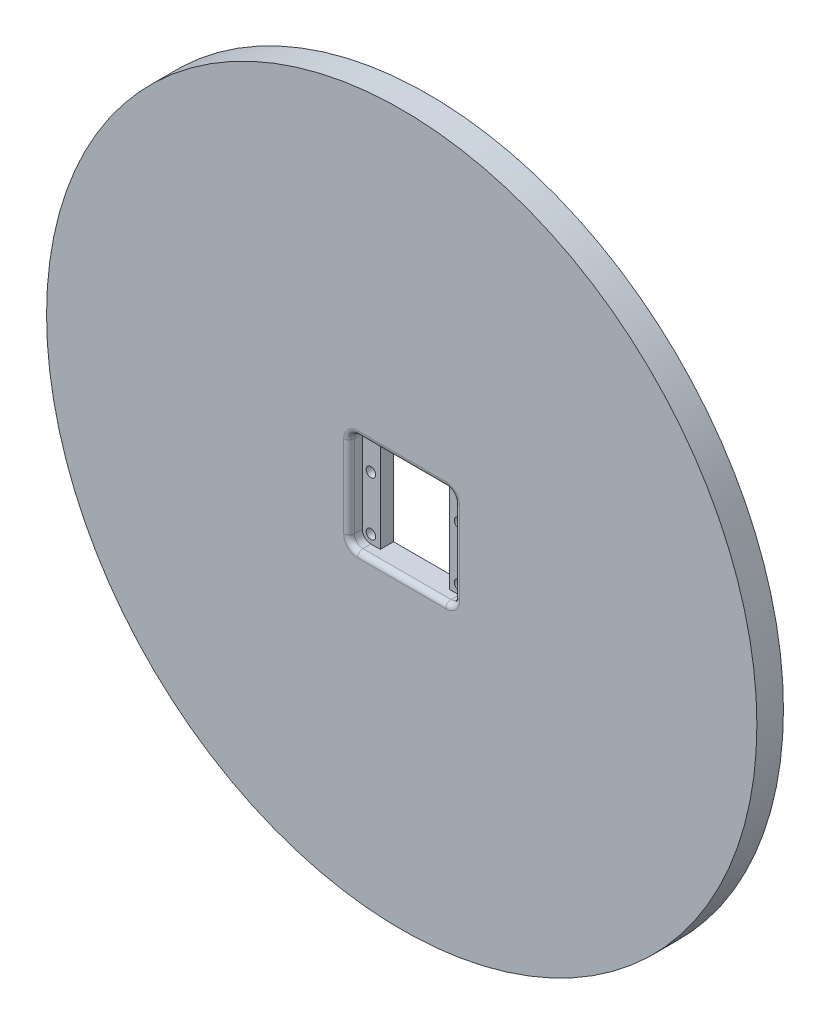
ISO-10303-21;
HEADER;
FILE_DESCRIPTION(('STEP AP214'),'2;1');
FILE_NAME('part.step','',(''),(''),'','','');
FILE_SCHEMA(('AUTOMOTIVE_DESIGN { 1 0 10303 214 1 1 1 1 }'));
ENDSEC;
DATA;
#1=APPLICATION_CONTEXT('core data for automotive mechanical design processes');
#2=APPLICATION_PROTOCOL_DEFINITION('international standard','automotive_design',2000,#1);
#3=PRODUCT_CONTEXT('',#1,'mechanical');
#4=PRODUCT('Part','Part','',(#3));
#5=PRODUCT_RELATED_PRODUCT_CATEGORY('part','',(#4));
#6=PRODUCT_DEFINITION_FORMATION('','',#4);
#7=PRODUCT_DEFINITION_CONTEXT('part definition',#1,'design');
#8=PRODUCT_DEFINITION('design','',#6,#7);
#9=PRODUCT_DEFINITION_SHAPE('','',#8);
#10=(LENGTH_UNIT() NAMED_UNIT(*) SI_UNIT(.MILLI.,.METRE.));
#11=(NAMED_UNIT(*) PLANE_ANGLE_UNIT() SI_UNIT($,.RADIAN.));
#12=(NAMED_UNIT(*) SI_UNIT($,.STERADIAN.) SOLID_ANGLE_UNIT());
#13=UNCERTAINTY_MEASURE_WITH_UNIT(LENGTH_MEASURE(1.E-05),#10,'distance_accuracy_value','');
#14=(GEOMETRIC_REPRESENTATION_CONTEXT(3) GLOBAL_UNCERTAINTY_ASSIGNED_CONTEXT((#13)) GLOBAL_UNIT_ASSIGNED_CONTEXT((#10,
#11,#12)) REPRESENTATION_CONTEXT('',''));
#15=CARTESIAN_POINT('',(0.,0.,0.));
#16=DIRECTION('',(0.,0.,1.));
#17=DIRECTION('',(1.,0.,0.));
#18=AXIS2_PLACEMENT_3D('',#15,#16,#17);
#19=CARTESIAN_POINT('',(0.,0.,3.175));
#20=DIRECTION('',(0.,0.,1.));
#21=DIRECTION('',(1.,0.,0.));
#22=AXIS2_PLACEMENT_3D('',#19,#20,#21);
#23=PLANE('',#22);
#24=DIRECTION('',(0.,-1.,0.));
#25=VECTOR('',#24,1.);
#26=CARTESIAN_POINT('',(-8.3058,11.8999,3.175));
#27=LINE('',#26,#25);
#28=CARTESIAN_POINT('',(-8.3058,11.8999,3.175));
#29=VERTEX_POINT('',#28);
#30=CARTESIAN_POINT('',(-8.3058,-11.8999,3.175));
#31=VERTEX_POINT('',#30);
#32=EDGE_CURVE('E173',#29,#31,#27,.T.);
#33=ORIENTED_EDGE('',*,*,#32,.F.);
#34=DIRECTION('',(1.,0.,0.));
#35=VECTOR('',#34,1.);
#36=CARTESIAN_POINT('',(10.541,11.8999,3.175));
#37=LINE('',#36,#35);
#38=CARTESIAN_POINT('',(-10.541,11.8999,3.175));
#39=VERTEX_POINT('',#38);
#40=EDGE_CURVE('E374',#39,#29,#37,.T.);
#41=ORIENTED_EDGE('',*,*,#40,.F.);
#42=CARTESIAN_POINT('',(-10.541,9.8425,3.175));
#43=DIRECTION('',(0.,0.,1.));
#44=DIRECTION('',(1.,0.,0.));
#45=AXIS2_PLACEMENT_3D('',#42,#43,#44);
#46=CIRCLE('',#45,2.0574);
#47=CARTESIAN_POINT('',(-12.5984,9.84249999999998,3.175));
#48=VERTEX_POINT('',#47);
#49=EDGE_CURVE('E377',#48,#39,#46,.F.);
#50=ORIENTED_EDGE('',*,*,#49,.F.);
#51=DIRECTION('',(0.,1.,0.));
#52=VECTOR('',#51,1.);
#53=CARTESIAN_POINT('',(-12.5984,9.84249999999998,3.175));
#54=LINE('',#53,#52);
#55=CARTESIAN_POINT('',(-12.5984,-9.84249999999999,3.175));
#56=VERTEX_POINT('',#55);
#57=EDGE_CURVE('E379',#56,#48,#54,.T.);
#58=ORIENTED_EDGE('',*,*,#57,.F.);
#59=CARTESIAN_POINT('',(-10.541,-9.8425,3.175));
#60=DIRECTION('',(0.,0.,1.));
#61=DIRECTION('',(1.,0.,0.));
#62=AXIS2_PLACEMENT_3D('',#59,#60,#61);
#63=CIRCLE('',#62,2.0574);
#64=CARTESIAN_POINT('',(-10.541,-11.8999,3.175));
#65=VERTEX_POINT('',#64);
#66=EDGE_CURVE('E186',#56,#65,#63,.T.);
#67=ORIENTED_EDGE('',*,*,#66,.T.);
#68=DIRECTION('',(1.,0.,0.));
#69=VECTOR('',#68,1.);
#70=CARTESIAN_POINT('',(10.541,-11.8999,3.175));
#71=LINE('',#70,#69);
#72=EDGE_CURVE('E163',#65,#31,#71,.T.);
#73=ORIENTED_EDGE('',*,*,#72,.T.);
#74=EDGE_LOOP('',(#33,#41,#50,#58,#67,#73));
#75=FACE_BOUND('',#74,.T.);
#76=CARTESIAN_POINT('',(-10.541,2.9845,3.175));
#77=DIRECTION('',(0.,0.,1.));
#78=DIRECTION('',(1.,0.,0.));
#79=AXIS2_PLACEMENT_3D('',#76,#77,#78);
#80=CIRCLE('',#79,1.143);
#81=CARTESIAN_POINT('',(-9.398,2.9845,3.175));
#82=VERTEX_POINT('',#81);
#83=EDGE_CURVE('E311',#82,#82,#80,.T.);
#84=ORIENTED_EDGE('',*,*,#83,.F.);
#85=EDGE_LOOP('',(#84));
#86=FACE_BOUND('',#85,.T.);
#87=CARTESIAN_POINT('',(-10.541,-9.8425,3.175));
#88=DIRECTION('',(0.,0.,1.));
#89=DIRECTION('',(1.,0.,0.));
#90=AXIS2_PLACEMENT_3D('',#87,#88,#89);
#91=CIRCLE('',#90,1.143);
#92=CARTESIAN_POINT('',(-9.398,-9.8425,3.175));
#93=VERTEX_POINT('',#92);
#94=EDGE_CURVE('E353',#93,#93,#91,.T.);
#95=ORIENTED_EDGE('',*,*,#94,.F.);
#96=EDGE_LOOP('',(#95));
#97=FACE_BOUND('',#96,.T.);
#98=ADVANCED_FACE('F43',(#75,#86,#97),#23,.T.);
#99=CARTESIAN_POINT('',(0.,0.,6.35));
#100=DIRECTION('',(0.,0.,1.));
#101=DIRECTION('',(1.,0.,0.));
#102=AXIS2_PLACEMENT_3D('',#99,#100,#101);
#103=PLANE('',#102);
#104=DIRECTION('',(0.,-1.,0.));
#105=VECTOR('',#104,1.);
#106=CARTESIAN_POINT('',(13.8684,0.,6.35));
#107=LINE('',#106,#105);
#108=CARTESIAN_POINT('',(13.8684,9.84249999999999,6.35));
#109=VERTEX_POINT('',#108);
#110=CARTESIAN_POINT('',(13.8684,-9.84249999999997,6.35));
#111=VERTEX_POINT('',#110);
#112=EDGE_CURVE('E255',#109,#111,#107,.T.);
#113=ORIENTED_EDGE('',*,*,#112,.T.);
#114=CARTESIAN_POINT('',(10.541,-9.8425,6.35));
#115=DIRECTION('',(0.,0.,1.));
#116=DIRECTION('',(1.,0.,0.));
#117=AXIS2_PLACEMENT_3D('',#114,#115,#116);
#118=CIRCLE('',#117,3.3274);
#119=CARTESIAN_POINT('',(10.541,-13.1699,6.35));
#120=VERTEX_POINT('',#119);
#121=EDGE_CURVE('E258',#111,#120,#118,.F.);
#122=ORIENTED_EDGE('',*,*,#121,.T.);
#123=DIRECTION('',(-1.,0.,0.));
#124=VECTOR('',#123,1.);
#125=CARTESIAN_POINT('',(0.,-13.1699,6.35));
#126=LINE('',#125,#124);
#127=CARTESIAN_POINT('',(-10.541,-13.1699,6.35));
#128=VERTEX_POINT('',#127);
#129=EDGE_CURVE('E236',#120,#128,#126,.T.);
#130=ORIENTED_EDGE('',*,*,#129,.T.);
#131=CARTESIAN_POINT('',(-10.541,-9.8425,6.35));
#132=DIRECTION('',(0.,0.,1.));
#133=DIRECTION('',(1.,0.,0.));
#134=AXIS2_PLACEMENT_3D('',#131,#132,#133);
#135=CIRCLE('',#134,3.3274);
#136=CARTESIAN_POINT('',(-13.8684,-9.84249999999999,6.35));
#137=VERTEX_POINT('',#136);
#138=EDGE_CURVE('E240',#128,#137,#135,.F.);
#139=ORIENTED_EDGE('',*,*,#138,.T.);
#140=DIRECTION('',(0.,-1.,0.));
#141=VECTOR('',#140,1.);
#142=CARTESIAN_POINT('',(-13.8684,9.84249999999998,6.35));
#143=LINE('',#142,#141);
#144=CARTESIAN_POINT('',(-13.8684,9.84249999999997,6.35));
#145=VERTEX_POINT('',#144);
#146=EDGE_CURVE('E243',#137,#145,#143,.F.);
#147=ORIENTED_EDGE('',*,*,#146,.T.);
#148=CARTESIAN_POINT('',(-10.541,9.8425,6.35));
#149=DIRECTION('',(0.,0.,1.));
#150=DIRECTION('',(1.,0.,0.));
#151=AXIS2_PLACEMENT_3D('',#148,#149,#150);
#152=CIRCLE('',#151,3.3274);
#153=CARTESIAN_POINT('',(-10.541,13.1699,6.35));
#154=VERTEX_POINT('',#153);
#155=EDGE_CURVE('E246',#145,#154,#152,.F.);
#156=ORIENTED_EDGE('',*,*,#155,.T.);
#157=DIRECTION('',(-1.,0.,0.));
#158=VECTOR('',#157,1.);
#159=CARTESIAN_POINT('',(10.541,13.1699,6.35));
#160=LINE('',#159,#158);
#161=CARTESIAN_POINT('',(10.541,13.1699,6.35));
#162=VERTEX_POINT('',#161);
#163=EDGE_CURVE('E249',#154,#162,#160,.F.);
#164=ORIENTED_EDGE('',*,*,#163,.T.);
#165=CARTESIAN_POINT('',(10.541,9.8425,6.35));
#166=DIRECTION('',(0.,0.,1.));
#167=DIRECTION('',(1.,0.,0.));
#168=AXIS2_PLACEMENT_3D('',#165,#166,#167);
#169=CIRCLE('',#168,3.3274);
#170=EDGE_CURVE('E252',#162,#109,#169,.F.);
#171=ORIENTED_EDGE('',*,*,#170,.T.);
#172=EDGE_LOOP('',(#113,#122,#130,#139,#147,#156,#164,#171));
#173=FACE_BOUND('',#172,.T.);
#174=CARTESIAN_POINT('',(0.,0.,6.35));
#175=DIRECTION('',(0.,0.,1.));
#176=DIRECTION('',(1.,0.,0.));
#177=AXIS2_PLACEMENT_3D('',#174,#175,#176);
#178=CIRCLE('',#177,84.93125);
#179=CARTESIAN_POINT('',(84.93125,0.,6.35));
#180=VERTEX_POINT('',#179);
#181=EDGE_CURVE('E194',#180,#180,#178,.T.);
#182=ORIENTED_EDGE('',*,*,#181,.T.);
#183=EDGE_LOOP('',(#182));
#184=FACE_BOUND('',#183,.T.);
#185=ADVANCED_FACE('F434',(#173,#184),#103,.T.);
#186=CARTESIAN_POINT('',(0.,0.,6.35));
#187=DIRECTION('',(0.,0.,-1.));
#188=DIRECTION('',(-1.,0.,0.));
#189=AXIS2_PLACEMENT_3D('',#186,#187,#188);
#190=CYLINDRICAL_SURFACE('',#189,84.93125);
#191=ORIENTED_EDGE('',*,*,#181,.F.);
#192=EDGE_LOOP('',(#191));
#193=FACE_BOUND('',#192,.T.);
#194=CARTESIAN_POINT('',(0.,0.,0.));
#195=DIRECTION('',(0.,0.,1.));
#196=DIRECTION('',(1.,0.,0.));
#197=AXIS2_PLACEMENT_3D('',#194,#195,#196);
#198=CIRCLE('',#197,84.93125);
#199=CARTESIAN_POINT('',(84.93125,0.,0.));
#200=VERTEX_POINT('',#199);
#201=EDGE_CURVE('E188',#200,#200,#198,.T.);
#202=ORIENTED_EDGE('',*,*,#201,.T.);
#203=EDGE_LOOP('',(#202));
#204=FACE_BOUND('',#203,.T.);
#205=ADVANCED_FACE('F437',(#193,#204),#190,.T.);
#206=CARTESIAN_POINT('',(0.,0.,0.));
#207=DIRECTION('',(0.,0.,1.));
#208=DIRECTION('',(1.,0.,0.));
#209=AXIS2_PLACEMENT_3D('',#206,#207,#208);
#210=PLANE('',#209);
#211=DIRECTION('',(1.,0.,0.));
#212=VECTOR('',#211,1.);
#213=CARTESIAN_POINT('',(8.3058,11.8999,0.));
#214=LINE('',#213,#212);
#215=CARTESIAN_POINT('',(-8.3058,11.8999,0.));
#216=VERTEX_POINT('',#215);
#217=CARTESIAN_POINT('',(8.3058,11.8999,0.));
#218=VERTEX_POINT('',#217);
#219=EDGE_CURVE('E334',#216,#218,#214,.T.);
#220=ORIENTED_EDGE('',*,*,#219,.F.);
#221=DIRECTION('',(0.,1.,0.));
#222=VECTOR('',#221,1.);
#223=CARTESIAN_POINT('',(-8.3058,11.8999,0.));
#224=LINE('',#223,#222);
#225=CARTESIAN_POINT('',(-8.3058,-11.8999,0.));
#226=VERTEX_POINT('',#225);
#227=EDGE_CURVE('E337',#226,#216,#224,.T.);
#228=ORIENTED_EDGE('',*,*,#227,.F.);
#229=DIRECTION('',(-1.,0.,0.));
#230=VECTOR('',#229,1.);
#231=CARTESIAN_POINT('',(8.3058,-11.8999,0.));
#232=LINE('',#231,#230);
#233=CARTESIAN_POINT('',(8.3058,-11.8999,0.));
#234=VERTEX_POINT('',#233);
#235=EDGE_CURVE('E165',#234,#226,#232,.T.);
#236=ORIENTED_EDGE('',*,*,#235,.F.);
#237=DIRECTION('',(0.,-1.,0.));
#238=VECTOR('',#237,1.);
#239=CARTESIAN_POINT('',(8.3058,-11.8999,0.));
#240=LINE('',#239,#238);
#241=EDGE_CURVE('E330',#218,#234,#240,.T.);
#242=ORIENTED_EDGE('',*,*,#241,.F.);
#243=EDGE_LOOP('',(#220,#228,#236,#242));
#244=FACE_BOUND('',#243,.T.);
#245=CARTESIAN_POINT('',(-10.541,-9.8425,0.));
#246=DIRECTION('',(0.,0.,1.));
#247=DIRECTION('',(1.,0.,0.));
#248=AXIS2_PLACEMENT_3D('',#245,#246,#247);
#249=CIRCLE('',#248,1.143);
#250=CARTESIAN_POINT('',(-9.398,-9.8425,0.));
#251=VERTEX_POINT('',#250);
#252=EDGE_CURVE('E181',#251,#251,#249,.F.);
#253=ORIENTED_EDGE('',*,*,#252,.F.);
#254=EDGE_LOOP('',(#253));
#255=FACE_BOUND('',#254,.T.);
#256=CARTESIAN_POINT('',(10.541,2.9845,0.));
#257=DIRECTION('',(0.,0.,1.));
#258=DIRECTION('',(1.,0.,0.));
#259=AXIS2_PLACEMENT_3D('',#256,#257,#258);
#260=CIRCLE('',#259,1.143);
#261=CARTESIAN_POINT('',(11.684,2.9845,0.));
#262=VERTEX_POINT('',#261);
#263=EDGE_CURVE('E327',#262,#262,#260,.F.);
#264=ORIENTED_EDGE('',*,*,#263,.F.);
#265=EDGE_LOOP('',(#264));
#266=FACE_BOUND('',#265,.T.);
#267=CARTESIAN_POINT('',(-10.541,2.9845,0.));
#268=DIRECTION('',(0.,0.,1.));
#269=DIRECTION('',(1.,0.,0.));
#270=AXIS2_PLACEMENT_3D('',#267,#268,#269);
#271=CIRCLE('',#270,1.143);
#272=CARTESIAN_POINT('',(-9.398,2.9845,0.));
#273=VERTEX_POINT('',#272);
#274=EDGE_CURVE('E318',#273,#273,#271,.F.);
#275=ORIENTED_EDGE('',*,*,#274,.F.);
#276=EDGE_LOOP('',(#275));
#277=FACE_BOUND('',#276,.T.);
#278=CARTESIAN_POINT('',(10.541,-9.8425,0.));
#279=DIRECTION('',(0.,0.,1.));
#280=DIRECTION('',(1.,0.,0.));
#281=AXIS2_PLACEMENT_3D('',#278,#279,#280);
#282=CIRCLE('',#281,1.143);
#283=CARTESIAN_POINT('',(11.684,-9.8425,0.));
#284=VERTEX_POINT('',#283);
#285=EDGE_CURVE('E204',#284,#284,#282,.F.);
#286=ORIENTED_EDGE('',*,*,#285,.F.);
#287=EDGE_LOOP('',(#286));
#288=FACE_BOUND('',#287,.T.);
#289=ORIENTED_EDGE('',*,*,#201,.F.);
#290=EDGE_LOOP('',(#289));
#291=FACE_BOUND('',#290,.T.);
#292=ADVANCED_FACE('F443',(#244,#255,#266,#277,#288,#291),#210,.F.);
#293=CARTESIAN_POINT('',(10.541,-9.8425,-34.659907822728));
#294=DIRECTION('',(0.,0.,1.));
#295=DIRECTION('',(1.,0.,0.));
#296=AXIS2_PLACEMENT_3D('',#293,#294,#295);
#297=CYLINDRICAL_SURFACE('',#296,2.0574);
#298=DIRECTION('',(0.,0.,1.));
#299=VECTOR('',#298,1.);
#300=CARTESIAN_POINT('',(10.541,-11.8999,-34.659907822728));
#301=LINE('',#300,#299);
#302=CARTESIAN_POINT('',(10.541,-11.8999,3.175));
#303=VERTEX_POINT('',#302);
#304=CARTESIAN_POINT('',(10.541,-11.8999,5.08));
#305=VERTEX_POINT('',#304);
#306=EDGE_CURVE('E199',#303,#305,#301,.T.);
#307=ORIENTED_EDGE('',*,*,#306,.T.);
#308=CARTESIAN_POINT('',(10.541,-9.8425,5.08));
#309=DIRECTION('',(0.,0.,1.));
#310=DIRECTION('',(1.,0.,0.));
#311=AXIS2_PLACEMENT_3D('',#308,#309,#310);
#312=CIRCLE('',#311,2.0574);
#313=CARTESIAN_POINT('',(12.5984,-9.84249999999999,5.08));
#314=VERTEX_POINT('',#313);
#315=EDGE_CURVE('E262',#305,#314,#312,.T.);
#316=ORIENTED_EDGE('',*,*,#315,.T.);
#317=DIRECTION('',(0.,0.,1.));
#318=VECTOR('',#317,1.);
#319=CARTESIAN_POINT('',(12.5984,-9.84249999999999,-34.659907822728));
#320=LINE('',#319,#318);
#321=CARTESIAN_POINT('',(12.5984,-9.84249999999999,3.175));
#322=VERTEX_POINT('',#321);
#323=EDGE_CURVE('E203',#322,#314,#320,.T.);
#324=ORIENTED_EDGE('',*,*,#323,.F.);
#325=CARTESIAN_POINT('',(10.541,-9.8425,3.175));
#326=DIRECTION('',(0.,0.,1.));
#327=DIRECTION('',(1.,0.,0.));
#328=AXIS2_PLACEMENT_3D('',#325,#326,#327);
#329=CIRCLE('',#328,2.0574);
#330=EDGE_CURVE('E229',#303,#322,#329,.T.);
#331=ORIENTED_EDGE('',*,*,#330,.F.);
#332=EDGE_LOOP('',(#307,#316,#324,#331));
#333=FACE_BOUND('',#332,.T.);
#334=ADVANCED_FACE('F410',(#333),#297,.F.);
#335=CARTESIAN_POINT('',(12.5984,9.84249999999999,-34.659907822728));
#336=DIRECTION('',(-1.,0.,0.));
#337=DIRECTION('',(0.,-1.,0.));
#338=AXIS2_PLACEMENT_3D('',#335,#336,#337);
#339=PLANE('',#338);
#340=ORIENTED_EDGE('',*,*,#323,.T.);
#341=DIRECTION('',(0.,-1.,0.));
#342=VECTOR('',#341,1.);
#343=CARTESIAN_POINT('',(12.5984,9.84249999999999,5.08));
#344=LINE('',#343,#342);
#345=CARTESIAN_POINT('',(12.5984,9.84249999999999,5.08));
#346=VERTEX_POINT('',#345);
#347=EDGE_CURVE('E266',#314,#346,#344,.F.);
#348=ORIENTED_EDGE('',*,*,#347,.T.);
#349=DIRECTION('',(0.,0.,1.));
#350=VECTOR('',#349,1.);
#351=CARTESIAN_POINT('',(12.5984,9.84249999999999,-34.659907822728));
#352=LINE('',#351,#350);
#353=CARTESIAN_POINT('',(12.5984,9.84249999999999,3.175));
#354=VERTEX_POINT('',#353);
#355=EDGE_CURVE('E208',#354,#346,#352,.T.);
#356=ORIENTED_EDGE('',*,*,#355,.F.);
#357=DIRECTION('',(0.,1.,0.));
#358=VECTOR('',#357,1.);
#359=CARTESIAN_POINT('',(12.5984,9.84249999999999,3.175));
#360=LINE('',#359,#358);
#361=EDGE_CURVE('E233',#322,#354,#360,.T.);
#362=ORIENTED_EDGE('',*,*,#361,.F.);
#363=EDGE_LOOP('',(#340,#348,#356,#362));
#364=FACE_BOUND('',#363,.T.);
#365=ADVANCED_FACE('F423',(#364),#339,.T.);
#366=CARTESIAN_POINT('',(10.541,9.8425,-34.659907822728));
#367=DIRECTION('',(0.,0.,1.));
#368=DIRECTION('',(1.,0.,0.));
#369=AXIS2_PLACEMENT_3D('',#366,#367,#368);
#370=CYLINDRICAL_SURFACE('',#369,2.0574);
#371=ORIENTED_EDGE('',*,*,#355,.T.);
#372=CARTESIAN_POINT('',(10.541,9.8425,5.08));
#373=DIRECTION('',(0.,0.,1.));
#374=DIRECTION('',(1.,0.,0.));
#375=AXIS2_PLACEMENT_3D('',#372,#373,#374);
#376=CIRCLE('',#375,2.0574);
#377=CARTESIAN_POINT('',(10.541,11.8999,5.08));
#378=VERTEX_POINT('',#377);
#379=EDGE_CURVE('E269',#346,#378,#376,.T.);
#380=ORIENTED_EDGE('',*,*,#379,.T.);
#381=DIRECTION('',(0.,0.,1.));
#382=VECTOR('',#381,1.);
#383=CARTESIAN_POINT('',(10.541,11.8999,-34.659907822728));
#384=LINE('',#383,#382);
#385=CARTESIAN_POINT('',(10.541,11.8999,3.175));
#386=VERTEX_POINT('',#385);
#387=EDGE_CURVE('E212',#386,#378,#384,.T.);
#388=ORIENTED_EDGE('',*,*,#387,.F.);
#389=CARTESIAN_POINT('',(10.541,9.8425,3.175));
#390=DIRECTION('',(0.,0.,1.));
#391=DIRECTION('',(1.,0.,0.));
#392=AXIS2_PLACEMENT_3D('',#389,#390,#391);
#393=CIRCLE('',#392,2.0574);
#394=EDGE_CURVE('E369',#354,#386,#393,.T.);
#395=ORIENTED_EDGE('',*,*,#394,.F.);
#396=EDGE_LOOP('',(#371,#380,#388,#395));
#397=FACE_BOUND('',#396,.T.);
#398=ADVANCED_FACE('F426',(#397),#370,.F.);
#399=CARTESIAN_POINT('',(10.541,11.8999,-34.659907822728));
#400=DIRECTION('',(0.,1.,0.));
#401=DIRECTION('',(-1.,0.,0.));
#402=AXIS2_PLACEMENT_3D('',#399,#400,#401);
#403=PLANE('',#402);
#404=ORIENTED_EDGE('',*,*,#387,.T.);
#405=DIRECTION('',(-1.,0.,0.));
#406=VECTOR('',#405,1.);
#407=CARTESIAN_POINT('',(-10.541,11.8999,5.08));
#408=LINE('',#407,#406);
#409=CARTESIAN_POINT('',(-10.541,11.8999,5.08));
#410=VERTEX_POINT('',#409);
#411=EDGE_CURVE('E272',#378,#410,#408,.T.);
#412=ORIENTED_EDGE('',*,*,#411,.T.);
#413=DIRECTION('',(0.,0.,1.));
#414=VECTOR('',#413,1.);
#415=CARTESIAN_POINT('',(-10.541,11.8999,-34.659907822728));
#416=LINE('',#415,#414);
#417=EDGE_CURVE('E216',#39,#410,#416,.T.);
#418=ORIENTED_EDGE('',*,*,#417,.F.);
#419=ORIENTED_EDGE('',*,*,#40,.T.);
#420=DIRECTION('',(0.,0.,1.));
#421=VECTOR('',#420,1.);
#422=CARTESIAN_POINT('',(-8.3058,11.8999,-29.023709869691));
#423=LINE('',#422,#421);
#424=EDGE_CURVE('E176',#216,#29,#423,.T.);
#425=ORIENTED_EDGE('',*,*,#424,.F.);
#426=ORIENTED_EDGE('',*,*,#219,.T.);
#427=DIRECTION('',(0.,0.,1.));
#428=VECTOR('',#427,1.);
#429=CARTESIAN_POINT('',(8.3058,11.8999,-29.023709869691));
#430=LINE('',#429,#428);
#431=CARTESIAN_POINT('',(8.3058,11.8999,3.175));
#432=VERTEX_POINT('',#431);
#433=EDGE_CURVE('E345',#218,#432,#430,.T.);
#434=ORIENTED_EDGE('',*,*,#433,.T.);
#435=EDGE_CURVE('E373',#432,#386,#37,.T.);
#436=ORIENTED_EDGE('',*,*,#435,.T.);
#437=EDGE_LOOP('',(#404,#412,#418,#419,#425,#426,#434,#436));
#438=FACE_BOUND('',#437,.T.);
#439=ADVANCED_FACE('F390',(#438),#403,.F.);
#440=CARTESIAN_POINT('',(-10.541,9.8425,-34.659907822728));
#441=DIRECTION('',(0.,0.,1.));
#442=DIRECTION('',(1.,0.,0.));
#443=AXIS2_PLACEMENT_3D('',#440,#441,#442);
#444=CYLINDRICAL_SURFACE('',#443,2.0574);
#445=ORIENTED_EDGE('',*,*,#417,.T.);
#446=CARTESIAN_POINT('',(-10.541,9.8425,5.08));
#447=DIRECTION('',(0.,0.,1.));
#448=DIRECTION('',(1.,0.,0.));
#449=AXIS2_PLACEMENT_3D('',#446,#447,#448);
#450=CIRCLE('',#449,2.0574);
#451=CARTESIAN_POINT('',(-12.5984,9.84249999999998,5.08));
#452=VERTEX_POINT('',#451);
#453=EDGE_CURVE('E275',#410,#452,#450,.T.);
#454=ORIENTED_EDGE('',*,*,#453,.T.);
#455=DIRECTION('',(0.,0.,1.));
#456=VECTOR('',#455,1.);
#457=CARTESIAN_POINT('',(-12.5984,9.84249999999998,-34.659907822728));
#458=LINE('',#457,#456);
#459=EDGE_CURVE('E220',#48,#452,#458,.T.);
#460=ORIENTED_EDGE('',*,*,#459,.F.);
#461=ORIENTED_EDGE('',*,*,#49,.T.);
#462=EDGE_LOOP('',(#445,#454,#460,#461));
#463=FACE_BOUND('',#462,.T.);
#464=ADVANCED_FACE('F386',(#463),#444,.F.);
#465=CARTESIAN_POINT('',(-12.5984,9.84249999999998,-34.659907822728));
#466=DIRECTION('',(-1.,0.,0.));
#467=DIRECTION('',(0.,-1.,0.));
#468=AXIS2_PLACEMENT_3D('',#465,#466,#467);
#469=PLANE('',#468);
#470=ORIENTED_EDGE('',*,*,#459,.T.);
#471=DIRECTION('',(0.,-1.,0.));
#472=VECTOR('',#471,1.);
#473=CARTESIAN_POINT('',(-12.5984,-9.84249999999999,5.08));
#474=LINE('',#473,#472);
#475=CARTESIAN_POINT('',(-12.5984,-9.84249999999999,5.08));
#476=VERTEX_POINT('',#475);
#477=EDGE_CURVE('E68',#452,#476,#474,.T.);
#478=ORIENTED_EDGE('',*,*,#477,.T.);
#479=DIRECTION('',(0.,0.,1.));
#480=VECTOR('',#479,1.);
#481=CARTESIAN_POINT('',(-12.5984,-9.84249999999999,-34.659907822728));
#482=LINE('',#481,#480);
#483=EDGE_CURVE('E223',#56,#476,#482,.T.);
#484=ORIENTED_EDGE('',*,*,#483,.F.);
#485=ORIENTED_EDGE('',*,*,#57,.T.);
#486=EDGE_LOOP('',(#470,#478,#484,#485));
#487=FACE_BOUND('',#486,.T.);
#488=ADVANCED_FACE('F383',(#487),#469,.F.);
#489=CARTESIAN_POINT('',(-10.541,-9.8425,-34.659907822728));
#490=DIRECTION('',(0.,0.,1.));
#491=DIRECTION('',(1.,0.,0.));
#492=AXIS2_PLACEMENT_3D('',#489,#490,#491);
#493=CYLINDRICAL_SURFACE('',#492,2.0574);
#494=ORIENTED_EDGE('',*,*,#483,.T.);
#495=CARTESIAN_POINT('',(-10.541,-9.8425,5.08));
#496=DIRECTION('',(0.,0.,1.));
#497=DIRECTION('',(1.,0.,0.));
#498=AXIS2_PLACEMENT_3D('',#495,#496,#497);
#499=CIRCLE('',#498,2.0574);
#500=CARTESIAN_POINT('',(-10.541,-11.8999,5.08));
#501=VERTEX_POINT('',#500);
#502=EDGE_CURVE('E53',#476,#501,#499,.T.);
#503=ORIENTED_EDGE('',*,*,#502,.T.);
#504=DIRECTION('',(0.,0.,1.));
#505=VECTOR('',#504,1.);
#506=CARTESIAN_POINT('',(-10.541,-11.8999,-34.659907822728));
#507=LINE('',#506,#505);
#508=EDGE_CURVE('E226',#65,#501,#507,.T.);
#509=ORIENTED_EDGE('',*,*,#508,.F.);
#510=ORIENTED_EDGE('',*,*,#66,.F.);
#511=EDGE_LOOP('',(#494,#503,#509,#510));
#512=FACE_BOUND('',#511,.T.);
#513=ADVANCED_FACE('F470',(#512),#493,.F.);
#514=CARTESIAN_POINT('',(10.541,-11.8999,-34.659907822728));
#515=DIRECTION('',(0.,1.,0.));
#516=DIRECTION('',(-1.,0.,0.));
#517=AXIS2_PLACEMENT_3D('',#514,#515,#516);
#518=PLANE('',#517);
#519=ORIENTED_EDGE('',*,*,#508,.T.);
#520=DIRECTION('',(-1.,0.,0.));
#521=VECTOR('',#520,1.);
#522=CARTESIAN_POINT('',(10.541,-11.8999,5.08));
#523=LINE('',#522,#521);
#524=EDGE_CURVE('E12',#501,#305,#523,.F.);
#525=ORIENTED_EDGE('',*,*,#524,.T.);
#526=ORIENTED_EDGE('',*,*,#306,.F.);
#527=CARTESIAN_POINT('',(8.3058,-11.8999,3.175));
#528=VERTEX_POINT('',#527);
#529=EDGE_CURVE('E189',#528,#303,#71,.T.);
#530=ORIENTED_EDGE('',*,*,#529,.F.);
#531=DIRECTION('',(0.,0.,1.));
#532=VECTOR('',#531,1.);
#533=CARTESIAN_POINT('',(8.3058,-11.8999,-29.023709869691));
#534=LINE('',#533,#532);
#535=EDGE_CURVE('E169',#234,#528,#534,.T.);
#536=ORIENTED_EDGE('',*,*,#535,.F.);
#537=ORIENTED_EDGE('',*,*,#235,.T.);
#538=DIRECTION('',(0.,0.,1.));
#539=VECTOR('',#538,1.);
#540=CARTESIAN_POINT('',(-8.3058,-11.8999,-29.023709869691));
#541=LINE('',#540,#539);
#542=EDGE_CURVE('E159',#226,#31,#541,.T.);
#543=ORIENTED_EDGE('',*,*,#542,.T.);
#544=ORIENTED_EDGE('',*,*,#72,.F.);
#545=EDGE_LOOP('',(#519,#525,#526,#530,#536,#537,#543,#544));
#546=FACE_BOUND('',#545,.T.);
#547=ADVANCED_FACE('F161',(#546),#518,.T.);
#548=DIRECTION('',(0.,1.,0.));
#549=VECTOR('',#548,1.);
#550=CARTESIAN_POINT('',(8.3058,-11.8999,3.175));
#551=LINE('',#550,#549);
#552=EDGE_CURVE('E170',#528,#432,#551,.T.);
#553=ORIENTED_EDGE('',*,*,#552,.F.);
#554=ORIENTED_EDGE('',*,*,#529,.T.);
#555=ORIENTED_EDGE('',*,*,#330,.T.);
#556=ORIENTED_EDGE('',*,*,#361,.T.);
#557=ORIENTED_EDGE('',*,*,#394,.T.);
#558=ORIENTED_EDGE('',*,*,#435,.F.);
#559=EDGE_LOOP('',(#553,#554,#555,#556,#557,#558));
#560=FACE_BOUND('',#559,.T.);
#561=CARTESIAN_POINT('',(10.541,2.9845,3.175));
#562=DIRECTION('',(0.,0.,1.));
#563=DIRECTION('',(1.,0.,0.));
#564=AXIS2_PLACEMENT_3D('',#561,#562,#563);
#565=CIRCLE('',#564,1.143);
#566=CARTESIAN_POINT('',(11.684,2.9845,3.175));
#567=VERTEX_POINT('',#566);
#568=EDGE_CURVE('E324',#567,#567,#565,.T.);
#569=ORIENTED_EDGE('',*,*,#568,.F.);
#570=EDGE_LOOP('',(#569));
#571=FACE_BOUND('',#570,.T.);
#572=CARTESIAN_POINT('',(10.541,-9.8425,3.175));
#573=DIRECTION('',(0.,0.,1.));
#574=DIRECTION('',(1.,0.,0.));
#575=AXIS2_PLACEMENT_3D('',#572,#573,#574);
#576=CIRCLE('',#575,1.143);
#577=CARTESIAN_POINT('',(11.684,-9.8425,3.175));
#578=VERTEX_POINT('',#577);
#579=EDGE_CURVE('E352',#578,#578,#576,.T.);
#580=ORIENTED_EDGE('',*,*,#579,.F.);
#581=EDGE_LOOP('',(#580));
#582=FACE_BOUND('',#581,.T.);
#583=ADVANCED_FACE('F457',(#560,#571,#582),#23,.T.);
#584=CARTESIAN_POINT('',(10.541,-9.8425,-29.023709869691));
#585=DIRECTION('',(0.,0.,1.));
#586=DIRECTION('',(1.,0.,0.));
#587=AXIS2_PLACEMENT_3D('',#584,#585,#586);
#588=CYLINDRICAL_SURFACE('',#587,1.143);
#589=ORIENTED_EDGE('',*,*,#285,.T.);
#590=EDGE_LOOP('',(#589));
#591=FACE_BOUND('',#590,.T.);
#592=ORIENTED_EDGE('',*,*,#579,.T.);
#593=EDGE_LOOP('',(#592));
#594=FACE_BOUND('',#593,.T.);
#595=ADVANCED_FACE('F462',(#591,#594),#588,.F.);
#596=CARTESIAN_POINT('',(-10.541,2.9845,-29.023709869691));
#597=DIRECTION('',(0.,0.,1.));
#598=DIRECTION('',(1.,0.,0.));
#599=AXIS2_PLACEMENT_3D('',#596,#597,#598);
#600=CYLINDRICAL_SURFACE('',#599,1.143);
#601=ORIENTED_EDGE('',*,*,#274,.T.);
#602=EDGE_LOOP('',(#601));
#603=FACE_BOUND('',#602,.T.);
#604=ORIENTED_EDGE('',*,*,#83,.T.);
#605=EDGE_LOOP('',(#604));
#606=FACE_BOUND('',#605,.T.);
#607=ADVANCED_FACE('F468',(#603,#606),#600,.F.);
#608=CARTESIAN_POINT('',(10.541,2.9845,-29.023709869691));
#609=DIRECTION('',(0.,0.,1.));
#610=DIRECTION('',(1.,0.,0.));
#611=AXIS2_PLACEMENT_3D('',#608,#609,#610);
#612=CYLINDRICAL_SURFACE('',#611,1.143);
#613=ORIENTED_EDGE('',*,*,#263,.T.);
#614=EDGE_LOOP('',(#613));
#615=FACE_BOUND('',#614,.T.);
#616=ORIENTED_EDGE('',*,*,#568,.T.);
#617=EDGE_LOOP('',(#616));
#618=FACE_BOUND('',#617,.T.);
#619=ADVANCED_FACE('F486',(#615,#618),#612,.F.);
#620=CARTESIAN_POINT('',(-10.541,-9.8425,-29.023709869691));
#621=DIRECTION('',(0.,0.,1.));
#622=DIRECTION('',(1.,0.,0.));
#623=AXIS2_PLACEMENT_3D('',#620,#621,#622);
#624=CYLINDRICAL_SURFACE('',#623,1.143);
#625=ORIENTED_EDGE('',*,*,#252,.T.);
#626=EDGE_LOOP('',(#625));
#627=FACE_BOUND('',#626,.T.);
#628=ORIENTED_EDGE('',*,*,#94,.T.);
#629=EDGE_LOOP('',(#628));
#630=FACE_BOUND('',#629,.T.);
#631=ADVANCED_FACE('F498',(#627,#630),#624,.F.);
#632=CARTESIAN_POINT('',(-8.3058,11.8999,-29.023709869691));
#633=DIRECTION('',(-1.,0.,0.));
#634=DIRECTION('',(0.,0.,1.));
#635=AXIS2_PLACEMENT_3D('',#632,#633,#634);
#636=PLANE('',#635);
#637=ORIENTED_EDGE('',*,*,#227,.T.);
#638=ORIENTED_EDGE('',*,*,#424,.T.);
#639=ORIENTED_EDGE('',*,*,#32,.T.);
#640=ORIENTED_EDGE('',*,*,#542,.F.);
#641=EDGE_LOOP('',(#637,#638,#639,#640));
#642=FACE_BOUND('',#641,.T.);
#643=ADVANCED_FACE('F174',(#642),#636,.F.);
#644=CARTESIAN_POINT('',(8.3058,-11.8999,-29.023709869691));
#645=DIRECTION('',(1.,0.,0.));
#646=DIRECTION('',(0.,0.,-1.));
#647=AXIS2_PLACEMENT_3D('',#644,#645,#646);
#648=PLANE('',#647);
#649=ORIENTED_EDGE('',*,*,#241,.T.);
#650=ORIENTED_EDGE('',*,*,#535,.T.);
#651=ORIENTED_EDGE('',*,*,#552,.T.);
#652=ORIENTED_EDGE('',*,*,#433,.F.);
#653=EDGE_LOOP('',(#649,#650,#651,#652));
#654=FACE_BOUND('',#653,.T.);
#655=ADVANCED_FACE('F501',(#654),#648,.F.);
#656=CARTESIAN_POINT('',(-10.541,9.8425,5.08));
#657=DIRECTION('',(0.,0.,1.));
#658=DIRECTION('',(1.,0.,0.));
#659=AXIS2_PLACEMENT_3D('',#656,#657,#658);
#660=TOROIDAL_SURFACE('',#659,3.3274,1.27);
#661=CARTESIAN_POINT('',(-13.8684,9.84249999999997,5.08));
#662=DIRECTION('',(0.,-1.,0.));
#663=DIRECTION('',(1.,0.,0.));
#664=AXIS2_PLACEMENT_3D('',#661,#662,#663);
#665=CIRCLE('',#664,1.27);
#666=EDGE_CURVE('E303',#452,#145,#665,.T.);
#667=ORIENTED_EDGE('',*,*,#666,.F.);
#668=ORIENTED_EDGE('',*,*,#453,.F.);
#669=CARTESIAN_POINT('',(-10.541,13.1699,5.08));
#670=DIRECTION('',(1.,0.,0.));
#671=DIRECTION('',(0.,0.,-1.));
#672=AXIS2_PLACEMENT_3D('',#669,#670,#671);
#673=CIRCLE('',#672,1.27);
#674=EDGE_CURVE('E47',#154,#410,#673,.T.);
#675=ORIENTED_EDGE('',*,*,#674,.F.);
#676=ORIENTED_EDGE('',*,*,#155,.F.);
#677=EDGE_LOOP('',(#667,#668,#675,#676));
#678=FACE_BOUND('',#677,.T.);
#679=ADVANCED_FACE('F45',(#678),#660,.T.);
#680=CARTESIAN_POINT('',(10.541,13.1699,5.08));
#681=DIRECTION('',(1.,0.,0.));
#682=DIRECTION('',(0.,1.,0.));
#683=AXIS2_PLACEMENT_3D('',#680,#681,#682);
#684=CYLINDRICAL_SURFACE('',#683,1.27);
#685=ORIENTED_EDGE('',*,*,#674,.T.);
#686=ORIENTED_EDGE('',*,*,#411,.F.);
#687=CARTESIAN_POINT('',(10.541,13.1699,5.08));
#688=DIRECTION('',(1.,0.,0.));
#689=DIRECTION('',(0.,1.,0.));
#690=AXIS2_PLACEMENT_3D('',#687,#688,#689);
#691=CIRCLE('',#690,1.27);
#692=EDGE_CURVE('E300',#162,#378,#691,.T.);
#693=ORIENTED_EDGE('',*,*,#692,.F.);
#694=ORIENTED_EDGE('',*,*,#163,.F.);
#695=EDGE_LOOP('',(#685,#686,#693,#694));
#696=FACE_BOUND('',#695,.T.);
#697=ADVANCED_FACE('F432',(#696),#684,.T.);
#698=CARTESIAN_POINT('',(-13.8684,9.84249999999998,5.08));
#699=DIRECTION('',(0.,1.,0.));
#700=DIRECTION('',(-1.,0.,0.));
#701=AXIS2_PLACEMENT_3D('',#698,#699,#700);
#702=CYLINDRICAL_SURFACE('',#701,1.27);
#703=ORIENTED_EDGE('',*,*,#666,.T.);
#704=ORIENTED_EDGE('',*,*,#146,.F.);
#705=CARTESIAN_POINT('',(-13.8684,-9.84249999999999,5.08));
#706=DIRECTION('',(0.,-1.,0.));
#707=DIRECTION('',(0.,0.,-1.));
#708=AXIS2_PLACEMENT_3D('',#705,#706,#707);
#709=CIRCLE('',#708,1.27);
#710=EDGE_CURVE('E296',#476,#137,#709,.T.);
#711=ORIENTED_EDGE('',*,*,#710,.F.);
#712=ORIENTED_EDGE('',*,*,#477,.F.);
#713=EDGE_LOOP('',(#703,#704,#711,#712));
#714=FACE_BOUND('',#713,.T.);
#715=ADVANCED_FACE('F395',(#714),#702,.T.);
#716=CARTESIAN_POINT('',(10.541,9.8425,5.08));
#717=DIRECTION('',(0.,0.,1.));
#718=DIRECTION('',(1.,0.,0.));
#719=AXIS2_PLACEMENT_3D('',#716,#717,#718);
#720=TOROIDAL_SURFACE('',#719,3.3274,1.27);
#721=ORIENTED_EDGE('',*,*,#692,.T.);
#722=ORIENTED_EDGE('',*,*,#379,.F.);
#723=CARTESIAN_POINT('',(13.8684,9.84249999999999,5.08));
#724=DIRECTION('',(0.,-1.,0.));
#725=DIRECTION('',(0.,0.,-1.));
#726=AXIS2_PLACEMENT_3D('',#723,#724,#725);
#727=CIRCLE('',#726,1.27);
#728=EDGE_CURVE('E292',#109,#346,#727,.T.);
#729=ORIENTED_EDGE('',*,*,#728,.F.);
#730=ORIENTED_EDGE('',*,*,#170,.F.);
#731=EDGE_LOOP('',(#721,#722,#729,#730));
#732=FACE_BOUND('',#731,.T.);
#733=ADVANCED_FACE('F429',(#732),#720,.T.);
#734=CARTESIAN_POINT('',(-10.541,-9.8425,5.08));
#735=DIRECTION('',(0.,0.,1.));
#736=DIRECTION('',(1.,0.,0.));
#737=AXIS2_PLACEMENT_3D('',#734,#735,#736);
#738=TOROIDAL_SURFACE('',#737,3.3274,1.27);
#739=ORIENTED_EDGE('',*,*,#710,.T.);
#740=ORIENTED_EDGE('',*,*,#138,.F.);
#741=CARTESIAN_POINT('',(-10.541,-13.1699,5.08));
#742=DIRECTION('',(1.,0.,0.));
#743=DIRECTION('',(0.,1.,0.));
#744=AXIS2_PLACEMENT_3D('',#741,#742,#743);
#745=CIRCLE('',#744,1.27);
#746=EDGE_CURVE('E288',#501,#128,#745,.T.);
#747=ORIENTED_EDGE('',*,*,#746,.F.);
#748=ORIENTED_EDGE('',*,*,#502,.F.);
#749=EDGE_LOOP('',(#739,#740,#747,#748));
#750=FACE_BOUND('',#749,.T.);
#751=ADVANCED_FACE('F399',(#750),#738,.T.);
#752=CARTESIAN_POINT('',(13.8684,0.,5.08));
#753=DIRECTION('',(0.,-1.,0.));
#754=DIRECTION('',(1.,0.,0.));
#755=AXIS2_PLACEMENT_3D('',#752,#753,#754);
#756=CYLINDRICAL_SURFACE('',#755,1.27);
#757=ORIENTED_EDGE('',*,*,#728,.T.);
#758=ORIENTED_EDGE('',*,*,#347,.F.);
#759=CARTESIAN_POINT('',(13.8684,-9.84249999999997,5.08));
#760=DIRECTION('',(0.,-1.,0.));
#761=DIRECTION('',(1.,0.,0.));
#762=AXIS2_PLACEMENT_3D('',#759,#760,#761);
#763=CIRCLE('',#762,1.27);
#764=EDGE_CURVE('E285',#111,#314,#763,.T.);
#765=ORIENTED_EDGE('',*,*,#764,.F.);
#766=ORIENTED_EDGE('',*,*,#112,.F.);
#767=EDGE_LOOP('',(#757,#758,#765,#766));
#768=FACE_BOUND('',#767,.T.);
#769=ADVANCED_FACE('F419',(#768),#756,.T.);
#770=CARTESIAN_POINT('',(0.,-13.1699,5.08));
#771=DIRECTION('',(-1.,0.,0.));
#772=DIRECTION('',(0.,-1.,0.));
#773=AXIS2_PLACEMENT_3D('',#770,#771,#772);
#774=CYLINDRICAL_SURFACE('',#773,1.27);
#775=ORIENTED_EDGE('',*,*,#746,.T.);
#776=ORIENTED_EDGE('',*,*,#129,.F.);
#777=CARTESIAN_POINT('',(10.541,-13.1699,5.08));
#778=DIRECTION('',(1.,0.,0.));
#779=DIRECTION('',(0.,0.,-1.));
#780=AXIS2_PLACEMENT_3D('',#777,#778,#779);
#781=CIRCLE('',#780,1.27);
#782=EDGE_CURVE('E282',#305,#120,#781,.T.);
#783=ORIENTED_EDGE('',*,*,#782,.F.);
#784=ORIENTED_EDGE('',*,*,#524,.F.);
#785=EDGE_LOOP('',(#775,#776,#783,#784));
#786=FACE_BOUND('',#785,.T.);
#787=ADVANCED_FACE('F404',(#786),#774,.T.);
#788=CARTESIAN_POINT('',(10.541,-9.8425,5.08));
#789=DIRECTION('',(0.,0.,1.));
#790=DIRECTION('',(1.,0.,0.));
#791=AXIS2_PLACEMENT_3D('',#788,#789,#790);
#792=TOROIDAL_SURFACE('',#791,3.3274,1.27);
#793=ORIENTED_EDGE('',*,*,#764,.T.);
#794=ORIENTED_EDGE('',*,*,#315,.F.);
#795=ORIENTED_EDGE('',*,*,#782,.T.);
#796=ORIENTED_EDGE('',*,*,#121,.F.);
#797=EDGE_LOOP('',(#793,#794,#795,#796));
#798=FACE_BOUND('',#797,.T.);
#799=ADVANCED_FACE('F413',(#798),#792,.T.);
#800=CLOSED_SHELL('',(#98,#185,#205,#292,#334,#365,#398,#439,#464,#488,#513,#547,#583,#595,#607,
#619,#631,#643,#655,#679,#697,#715,#733,#751,#769,#787,#799));
#801=MANIFOLD_SOLID_BREP('B2',#800);
#802=ADVANCED_BREP_SHAPE_REPRESENTATION('',(#18,#801),#14);
#803=SHAPE_DEFINITION_REPRESENTATION(#9,#802);
ENDSEC;
END-ISO-10303-21;
